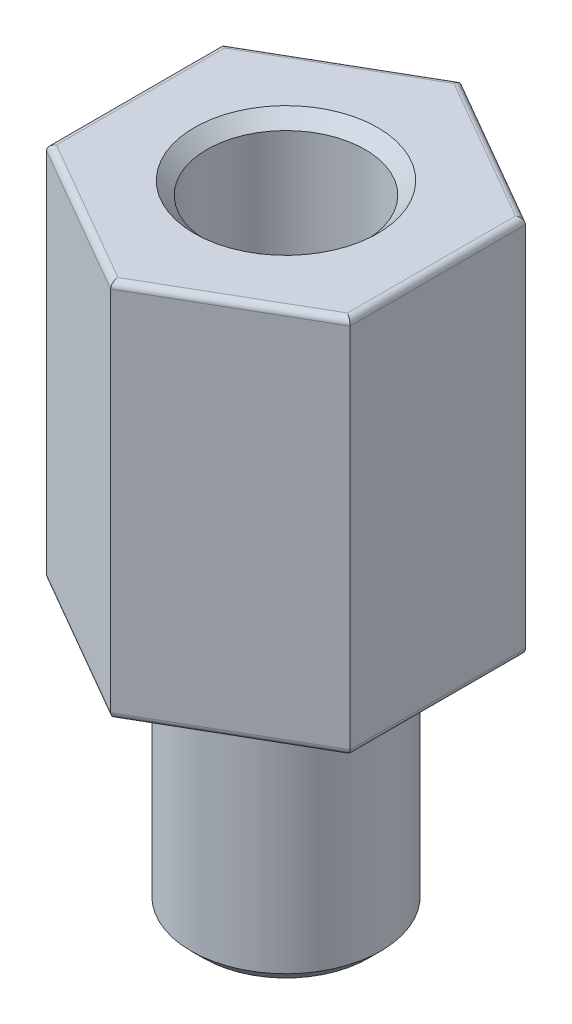
ISO-10303-21;
HEADER;
FILE_DESCRIPTION(('STEP AP214'),'2;1');
FILE_NAME('part.step','',(''),(''),'','','');
FILE_SCHEMA(('AUTOMOTIVE_DESIGN { 1 0 10303 214 1 1 1 1 }'));
ENDSEC;
DATA;
#1=APPLICATION_CONTEXT('core data for automotive mechanical design processes');
#2=APPLICATION_PROTOCOL_DEFINITION('international standard','automotive_design',2000,#1);
#3=PRODUCT_CONTEXT('',#1,'mechanical');
#4=PRODUCT('Part','Part','',(#3));
#5=PRODUCT_RELATED_PRODUCT_CATEGORY('part','',(#4));
#6=PRODUCT_DEFINITION_FORMATION('','',#4);
#7=PRODUCT_DEFINITION_CONTEXT('part definition',#1,'design');
#8=PRODUCT_DEFINITION('design','',#6,#7);
#9=PRODUCT_DEFINITION_SHAPE('','',#8);
#10=(LENGTH_UNIT() NAMED_UNIT(*) SI_UNIT(.MILLI.,.METRE.));
#11=(NAMED_UNIT(*) PLANE_ANGLE_UNIT() SI_UNIT($,.RADIAN.));
#12=(NAMED_UNIT(*) SI_UNIT($,.STERADIAN.) SOLID_ANGLE_UNIT());
#13=UNCERTAINTY_MEASURE_WITH_UNIT(LENGTH_MEASURE(1.E-05),#10,'distance_accuracy_value','');
#14=(GEOMETRIC_REPRESENTATION_CONTEXT(3) GLOBAL_UNCERTAINTY_ASSIGNED_CONTEXT((#13)) GLOBAL_UNIT_ASSIGNED_CONTEXT((#10,
#11,#12)) REPRESENTATION_CONTEXT('',''));
#15=CARTESIAN_POINT('',(0.,0.,0.));
#16=DIRECTION('',(0.,0.,1.));
#17=DIRECTION('',(1.,0.,0.));
#18=AXIS2_PLACEMENT_3D('',#15,#16,#17);
#19=CARTESIAN_POINT('',(0.,4.,0.));
#20=DIRECTION('',(0.,-1.,0.));
#21=DIRECTION('',(0.,0.,-1.));
#22=AXIS2_PLACEMENT_3D('',#19,#20,#21);
#23=CYLINDRICAL_SURFACE('',#22,1.5);
#24=CARTESIAN_POINT('',(0.,0.2,0.));
#25=DIRECTION('',(0.,1.,0.));
#26=DIRECTION('',(0.,0.,1.));
#27=AXIS2_PLACEMENT_3D('',#24,#25,#26);
#28=CIRCLE('',#27,1.5);
#29=CARTESIAN_POINT('',(0.,0.2,1.5));
#30=VERTEX_POINT('',#29);
#31=EDGE_CURVE('E214',#30,#30,#28,.T.);
#32=ORIENTED_EDGE('',*,*,#31,.T.);
#33=EDGE_LOOP('',(#32));
#34=FACE_BOUND('',#33,.T.);
#35=CARTESIAN_POINT('',(0.,4.,0.));
#36=DIRECTION('',(0.,1.,0.));
#37=DIRECTION('',(0.,0.,1.));
#38=AXIS2_PLACEMENT_3D('',#35,#36,#37);
#39=CIRCLE('',#38,1.5);
#40=CARTESIAN_POINT('',(0.,4.,1.5));
#41=VERTEX_POINT('',#40);
#42=EDGE_CURVE('E161',#41,#41,#39,.T.);
#43=ORIENTED_EDGE('',*,*,#42,.F.);
#44=EDGE_LOOP('',(#43));
#45=FACE_BOUND('',#44,.T.);
#46=ADVANCED_FACE('F36',(#34,#45),#23,.T.);
#47=CARTESIAN_POINT('',(0.,0.,0.));
#48=DIRECTION('',(0.,1.,0.));
#49=DIRECTION('',(0.,0.,1.));
#50=AXIS2_PLACEMENT_3D('',#47,#48,#49);
#51=PLANE('',#50);
#52=CARTESIAN_POINT('',(0.,0.,0.));
#53=DIRECTION('',(0.,1.,0.));
#54=DIRECTION('',(0.,0.,1.));
#55=AXIS2_PLACEMENT_3D('',#52,#53,#54);
#56=CIRCLE('',#55,1.3);
#57=CARTESIAN_POINT('',(0.,0.,1.3));
#58=VERTEX_POINT('',#57);
#59=EDGE_CURVE('E245',#58,#58,#56,.F.);
#60=ORIENTED_EDGE('',*,*,#59,.T.);
#61=EDGE_LOOP('',(#60));
#62=FACE_BOUND('',#61,.T.);
#63=ADVANCED_FACE('F260',(#62),#51,.F.);
#64=CARTESIAN_POINT('',(0.,4.,0.));
#65=DIRECTION('',(0.,1.,0.));
#66=DIRECTION('',(0.,0.,1.));
#67=AXIS2_PLACEMENT_3D('',#64,#65,#66);
#68=PLANE('',#67);
#69=DIRECTION('',(-0.866025403784439,0.,-0.5));
#70=VECTOR('',#69,1.);
#71=CARTESIAN_POINT('',(1.15,4.,-1.99185842870421));
#72=LINE('',#71,#70);
#73=CARTESIAN_POINT('',(0.,4.,-2.65581123827228));
#74=VERTEX_POINT('',#73);
#75=CARTESIAN_POINT('',(2.3,4.,-1.32790561913614));
#76=VERTEX_POINT('',#75);
#77=EDGE_CURVE('E169',#74,#76,#72,.F.);
#78=ORIENTED_EDGE('',*,*,#77,.T.);
#79=DIRECTION('',(0.,0.,-1.));
#80=VECTOR('',#79,1.);
#81=CARTESIAN_POINT('',(2.3,4.,0.));
#82=LINE('',#81,#80);
#83=CARTESIAN_POINT('',(2.3,4.,1.32790561913614));
#84=VERTEX_POINT('',#83);
#85=EDGE_CURVE('E179',#76,#84,#82,.F.);
#86=ORIENTED_EDGE('',*,*,#85,.T.);
#87=DIRECTION('',(0.866025403784438,0.,-0.5));
#88=VECTOR('',#87,1.);
#89=CARTESIAN_POINT('',(1.15,4.,1.99185842870421));
#90=LINE('',#89,#88);
#91=CARTESIAN_POINT('',(0.,4.,2.65581123827228));
#92=VERTEX_POINT('',#91);
#93=EDGE_CURVE('E177',#84,#92,#90,.F.);
#94=ORIENTED_EDGE('',*,*,#93,.T.);
#95=DIRECTION('',(0.866025403784439,0.,0.5));
#96=VECTOR('',#95,1.);
#97=CARTESIAN_POINT('',(-1.15,4.,1.99185842870421));
#98=LINE('',#97,#96);
#99=CARTESIAN_POINT('',(-2.3,4.,1.32790561913614));
#100=VERTEX_POINT('',#99);
#101=EDGE_CURVE('E175',#92,#100,#98,.F.);
#102=ORIENTED_EDGE('',*,*,#101,.T.);
#103=DIRECTION('',(0.,0.,1.));
#104=VECTOR('',#103,1.);
#105=CARTESIAN_POINT('',(-2.3,4.,0.));
#106=LINE('',#105,#104);
#107=CARTESIAN_POINT('',(-2.3,4.,-1.32790561913614));
#108=VERTEX_POINT('',#107);
#109=EDGE_CURVE('E173',#100,#108,#106,.F.);
#110=ORIENTED_EDGE('',*,*,#109,.T.);
#111=DIRECTION('',(-0.866025403784439,0.,0.5));
#112=VECTOR('',#111,1.);
#113=CARTESIAN_POINT('',(-1.15,4.,-1.99185842870421));
#114=LINE('',#113,#112);
#115=EDGE_CURVE('E171',#108,#74,#114,.F.);
#116=ORIENTED_EDGE('',*,*,#115,.T.);
#117=EDGE_LOOP('',(#78,#86,#94,#102,#110,#116));
#118=FACE_BOUND('',#117,.T.);
#119=ORIENTED_EDGE('',*,*,#42,.T.);
#120=EDGE_LOOP('',(#119));
#121=FACE_BOUND('',#120,.T.);
#122=ADVANCED_FACE('F266',(#118,#121),#68,.F.);
#123=CARTESIAN_POINT('',(0.,10.,-2.7712812921102));
#124=DIRECTION('',(0.5,0.,0.866025403784439));
#125=DIRECTION('',(0.866025403784439,0.,-0.5));
#126=AXIS2_PLACEMENT_3D('',#123,#124,#125);
#127=PLANE('',#126);
#128=DIRECTION('',(0.,-1.,0.));
#129=VECTOR('',#128,1.);
#130=CARTESIAN_POINT('',(0.,10.,-2.7712812921102));
#131=LINE('',#130,#129);
#132=CARTESIAN_POINT('',(0.,9.9,-2.7712812921102));
#133=VERTEX_POINT('',#132);
#134=CARTESIAN_POINT('',(0.,4.1,-2.7712812921102));
#135=VERTEX_POINT('',#134);
#136=EDGE_CURVE('E142',#133,#135,#131,.T.);
#137=ORIENTED_EDGE('',*,*,#136,.T.);
#138=DIRECTION('',(-0.866025403784439,0.,0.5));
#139=VECTOR('',#138,1.);
#140=CARTESIAN_POINT('',(0.,4.1,-2.7712812921102));
#141=LINE('',#140,#139);
#142=CARTESIAN_POINT('',(-2.4,4.1,-1.3856406460551));
#143=VERTEX_POINT('',#142);
#144=EDGE_CURVE('E197',#135,#143,#141,.T.);
#145=ORIENTED_EDGE('',*,*,#144,.T.);
#146=DIRECTION('',(0.,-1.,0.));
#147=VECTOR('',#146,1.);
#148=CARTESIAN_POINT('',(-2.4,10.,-1.3856406460551));
#149=LINE('',#148,#147);
#150=CARTESIAN_POINT('',(-2.4,9.9,-1.3856406460551));
#151=VERTEX_POINT('',#150);
#152=EDGE_CURVE('E158',#151,#143,#149,.T.);
#153=ORIENTED_EDGE('',*,*,#152,.F.);
#154=DIRECTION('',(-0.866025403784439,0.,0.5));
#155=VECTOR('',#154,1.);
#156=CARTESIAN_POINT('',(0.,9.9,-2.7712812921102));
#157=LINE('',#156,#155);
#158=EDGE_CURVE('E194',#151,#133,#157,.F.);
#159=ORIENTED_EDGE('',*,*,#158,.T.);
#160=EDGE_LOOP('',(#137,#145,#153,#159));
#161=FACE_BOUND('',#160,.T.);
#162=ADVANCED_FACE('F365',(#161),#127,.F.);
#163=CARTESIAN_POINT('',(-2.4,10.,-1.3856406460551));
#164=DIRECTION('',(1.,0.,0.));
#165=DIRECTION('',(0.,0.,-1.));
#166=AXIS2_PLACEMENT_3D('',#163,#164,#165);
#167=PLANE('',#166);
#168=ORIENTED_EDGE('',*,*,#152,.T.);
#169=DIRECTION('',(0.,0.,1.));
#170=VECTOR('',#169,1.);
#171=CARTESIAN_POINT('',(-2.4,4.1,-1.3856406460551));
#172=LINE('',#171,#170);
#173=CARTESIAN_POINT('',(-2.4,4.1,1.3856406460551));
#174=VERTEX_POINT('',#173);
#175=EDGE_CURVE('E192',#143,#174,#172,.T.);
#176=ORIENTED_EDGE('',*,*,#175,.T.);
#177=DIRECTION('',(0.,-1.,0.));
#178=VECTOR('',#177,1.);
#179=CARTESIAN_POINT('',(-2.4,10.,1.3856406460551));
#180=LINE('',#179,#178);
#181=CARTESIAN_POINT('',(-2.4,9.9,1.3856406460551));
#182=VERTEX_POINT('',#181);
#183=EDGE_CURVE('E155',#182,#174,#180,.T.);
#184=ORIENTED_EDGE('',*,*,#183,.F.);
#185=DIRECTION('',(0.,0.,1.));
#186=VECTOR('',#185,1.);
#187=CARTESIAN_POINT('',(-2.4,9.9,-1.3856406460551));
#188=LINE('',#187,#186);
#189=EDGE_CURVE('E190',#182,#151,#188,.F.);
#190=ORIENTED_EDGE('',*,*,#189,.T.);
#191=EDGE_LOOP('',(#168,#176,#184,#190));
#192=FACE_BOUND('',#191,.T.);
#193=ADVANCED_FACE('F333',(#192),#167,.F.);
#194=CARTESIAN_POINT('',(-2.4,10.,1.3856406460551));
#195=DIRECTION('',(0.5,0.,-0.866025403784439));
#196=DIRECTION('',(-0.866025403784439,0.,-0.5));
#197=AXIS2_PLACEMENT_3D('',#194,#195,#196);
#198=PLANE('',#197);
#199=ORIENTED_EDGE('',*,*,#183,.T.);
#200=DIRECTION('',(0.866025403784439,0.,0.5));
#201=VECTOR('',#200,1.);
#202=CARTESIAN_POINT('',(-2.4,4.1,1.3856406460551));
#203=LINE('',#202,#201);
#204=CARTESIAN_POINT('',(0.,4.1,2.7712812921102));
#205=VERTEX_POINT('',#204);
#206=EDGE_CURVE('E188',#174,#205,#203,.T.);
#207=ORIENTED_EDGE('',*,*,#206,.T.);
#208=DIRECTION('',(0.,-1.,0.));
#209=VECTOR('',#208,1.);
#210=CARTESIAN_POINT('',(0.,10.,2.7712812921102));
#211=LINE('',#210,#209);
#212=CARTESIAN_POINT('',(0.,9.9,2.7712812921102));
#213=VERTEX_POINT('',#212);
#214=EDGE_CURVE('E152',#213,#205,#211,.T.);
#215=ORIENTED_EDGE('',*,*,#214,.F.);
#216=DIRECTION('',(0.866025403784439,0.,0.5));
#217=VECTOR('',#216,1.);
#218=CARTESIAN_POINT('',(-2.4,9.9,1.3856406460551));
#219=LINE('',#218,#217);
#220=EDGE_CURVE('E186',#213,#182,#219,.F.);
#221=ORIENTED_EDGE('',*,*,#220,.T.);
#222=EDGE_LOOP('',(#199,#207,#215,#221));
#223=FACE_BOUND('',#222,.T.);
#224=ADVANCED_FACE('F330',(#223),#198,.F.);
#225=CARTESIAN_POINT('',(0.,10.,2.7712812921102));
#226=DIRECTION('',(-0.5,0.,-0.866025403784438));
#227=DIRECTION('',(-0.866025403784438,0.,0.5));
#228=AXIS2_PLACEMENT_3D('',#225,#226,#227);
#229=PLANE('',#228);
#230=ORIENTED_EDGE('',*,*,#214,.T.);
#231=DIRECTION('',(0.866025403784438,0.,-0.5));
#232=VECTOR('',#231,1.);
#233=CARTESIAN_POINT('',(0.,4.1,2.7712812921102));
#234=LINE('',#233,#232);
#235=CARTESIAN_POINT('',(2.4,4.1,1.3856406460551));
#236=VERTEX_POINT('',#235);
#237=EDGE_CURVE('E184',#205,#236,#234,.T.);
#238=ORIENTED_EDGE('',*,*,#237,.T.);
#239=DIRECTION('',(0.,-1.,0.));
#240=VECTOR('',#239,1.);
#241=CARTESIAN_POINT('',(2.4,10.,1.3856406460551));
#242=LINE('',#241,#240);
#243=CARTESIAN_POINT('',(2.4,9.9,1.3856406460551));
#244=VERTEX_POINT('',#243);
#245=EDGE_CURVE('E149',#244,#236,#242,.T.);
#246=ORIENTED_EDGE('',*,*,#245,.F.);
#247=DIRECTION('',(0.866025403784438,0.,-0.5));
#248=VECTOR('',#247,1.);
#249=CARTESIAN_POINT('',(0.,9.9,2.7712812921102));
#250=LINE('',#249,#248);
#251=EDGE_CURVE('E182',#244,#213,#250,.F.);
#252=ORIENTED_EDGE('',*,*,#251,.T.);
#253=EDGE_LOOP('',(#230,#238,#246,#252));
#254=FACE_BOUND('',#253,.T.);
#255=ADVANCED_FACE('F350',(#254),#229,.F.);
#256=CARTESIAN_POINT('',(2.4,10.,1.3856406460551));
#257=DIRECTION('',(-1.,0.,0.));
#258=DIRECTION('',(0.,0.,1.));
#259=AXIS2_PLACEMENT_3D('',#256,#257,#258);
#260=PLANE('',#259);
#261=ORIENTED_EDGE('',*,*,#245,.T.);
#262=DIRECTION('',(0.,0.,-1.));
#263=VECTOR('',#262,1.);
#264=CARTESIAN_POINT('',(2.4,4.1,1.3856406460551));
#265=LINE('',#264,#263);
#266=CARTESIAN_POINT('',(2.4,4.1,-1.3856406460551));
#267=VERTEX_POINT('',#266);
#268=EDGE_CURVE('E166',#236,#267,#265,.T.);
#269=ORIENTED_EDGE('',*,*,#268,.T.);
#270=DIRECTION('',(0.,-1.,0.));
#271=VECTOR('',#270,1.);
#272=CARTESIAN_POINT('',(2.4,10.,-1.3856406460551));
#273=LINE('',#272,#271);
#274=CARTESIAN_POINT('',(2.4,9.9,-1.3856406460551));
#275=VERTEX_POINT('',#274);
#276=EDGE_CURVE('E145',#275,#267,#273,.T.);
#277=ORIENTED_EDGE('',*,*,#276,.F.);
#278=DIRECTION('',(0.,0.,-1.));
#279=VECTOR('',#278,1.);
#280=CARTESIAN_POINT('',(2.4,9.9,1.3856406460551));
#281=LINE('',#280,#279);
#282=EDGE_CURVE('E164',#275,#244,#281,.F.);
#283=ORIENTED_EDGE('',*,*,#282,.T.);
#284=EDGE_LOOP('',(#261,#269,#277,#283));
#285=FACE_BOUND('',#284,.T.);
#286=ADVANCED_FACE('F354',(#285),#260,.F.);
#287=CARTESIAN_POINT('',(2.4,10.,-1.3856406460551));
#288=DIRECTION('',(-0.5,0.,0.866025403784439));
#289=DIRECTION('',(0.866025403784439,0.,0.5));
#290=AXIS2_PLACEMENT_3D('',#287,#288,#289);
#291=PLANE('',#290);
#292=ORIENTED_EDGE('',*,*,#276,.T.);
#293=DIRECTION('',(-0.866025403784439,0.,-0.5));
#294=VECTOR('',#293,1.);
#295=CARTESIAN_POINT('',(2.4,4.1,-1.3856406460551));
#296=LINE('',#295,#294);
#297=EDGE_CURVE('E201',#267,#135,#296,.T.);
#298=ORIENTED_EDGE('',*,*,#297,.T.);
#299=ORIENTED_EDGE('',*,*,#136,.F.);
#300=DIRECTION('',(-0.866025403784439,0.,-0.5));
#301=VECTOR('',#300,1.);
#302=CARTESIAN_POINT('',(2.4,9.9,-1.3856406460551));
#303=LINE('',#302,#301);
#304=EDGE_CURVE('E199',#133,#275,#303,.F.);
#305=ORIENTED_EDGE('',*,*,#304,.T.);
#306=EDGE_LOOP('',(#292,#298,#299,#305));
#307=FACE_BOUND('',#306,.T.);
#308=ADVANCED_FACE('F363',(#307),#291,.F.);
#309=CARTESIAN_POINT('',(0.,10.,0.));
#310=DIRECTION('',(0.,1.,0.));
#311=DIRECTION('',(0.,0.,1.));
#312=AXIS2_PLACEMENT_3D('',#309,#310,#311);
#313=PLANE('',#312);
#314=CARTESIAN_POINT('',(0.,10.,0.));
#315=DIRECTION('',(0.,1.,0.));
#316=DIRECTION('',(0.,0.,1.));
#317=AXIS2_PLACEMENT_3D('',#314,#315,#316);
#318=CIRCLE('',#317,1.45);
#319=CARTESIAN_POINT('',(0.,10.,1.45));
#320=VERTEX_POINT('',#319);
#321=EDGE_CURVE('E11',#320,#320,#318,.F.);
#322=ORIENTED_EDGE('',*,*,#321,.T.);
#323=EDGE_LOOP('',(#322));
#324=FACE_BOUND('',#323,.T.);
#325=DIRECTION('',(-0.866025403784439,0.,-0.5));
#326=VECTOR('',#325,1.);
#327=CARTESIAN_POINT('',(-0.0500000000000006,10.,-2.68467875173176));
#328=LINE('',#327,#326);
#329=CARTESIAN_POINT('',(2.3,10.,-1.32790561913614));
#330=VERTEX_POINT('',#329);
#331=CARTESIAN_POINT('',(0.,10.,-2.65581123827228));
#332=VERTEX_POINT('',#331);
#333=EDGE_CURVE('E203',#330,#332,#328,.T.);
#334=ORIENTED_EDGE('',*,*,#333,.T.);
#335=DIRECTION('',(-0.866025403784439,0.,0.5));
#336=VECTOR('',#335,1.);
#337=CARTESIAN_POINT('',(-2.35,10.,-1.29903810567666));
#338=LINE('',#337,#336);
#339=CARTESIAN_POINT('',(-2.3,10.,-1.32790561913614));
#340=VERTEX_POINT('',#339);
#341=EDGE_CURVE('E212',#332,#340,#338,.T.);
#342=ORIENTED_EDGE('',*,*,#341,.T.);
#343=DIRECTION('',(0.,0.,1.));
#344=VECTOR('',#343,1.);
#345=CARTESIAN_POINT('',(-2.3,10.,1.3856406460551));
#346=LINE('',#345,#344);
#347=CARTESIAN_POINT('',(-2.3,10.,1.32790561913614));
#348=VERTEX_POINT('',#347);
#349=EDGE_CURVE('E58',#340,#348,#346,.T.);
#350=ORIENTED_EDGE('',*,*,#349,.T.);
#351=DIRECTION('',(0.866025403784439,0.,0.5));
#352=VECTOR('',#351,1.);
#353=CARTESIAN_POINT('',(0.0500000000000006,10.,2.68467875173176));
#354=LINE('',#353,#352);
#355=CARTESIAN_POINT('',(0.,10.,2.65581123827228));
#356=VERTEX_POINT('',#355);
#357=EDGE_CURVE('E209',#348,#356,#354,.T.);
#358=ORIENTED_EDGE('',*,*,#357,.T.);
#359=DIRECTION('',(0.866025403784438,0.,-0.5));
#360=VECTOR('',#359,1.);
#361=CARTESIAN_POINT('',(2.35,10.,1.29903810567666));
#362=LINE('',#361,#360);
#363=CARTESIAN_POINT('',(2.3,10.,1.32790561913614));
#364=VERTEX_POINT('',#363);
#365=EDGE_CURVE('E207',#356,#364,#362,.T.);
#366=ORIENTED_EDGE('',*,*,#365,.T.);
#367=DIRECTION('',(0.,0.,-1.));
#368=VECTOR('',#367,1.);
#369=CARTESIAN_POINT('',(2.3,10.,-1.3856406460551));
#370=LINE('',#369,#368);
#371=EDGE_CURVE('E205',#364,#330,#370,.T.);
#372=ORIENTED_EDGE('',*,*,#371,.T.);
#373=EDGE_LOOP('',(#334,#342,#350,#358,#366,#372));
#374=FACE_BOUND('',#373,.T.);
#375=ADVANCED_FACE('F296',(#324,#374),#313,.T.);
#376=CARTESIAN_POINT('',(-2.3,4.1,-1.3856406460551));
#377=DIRECTION('',(0.,0.,1.));
#378=DIRECTION('',(1.,0.,0.));
#379=AXIS2_PLACEMENT_3D('',#376,#377,#378);
#380=CYLINDRICAL_SURFACE('',#379,0.1);
#381=CARTESIAN_POINT('',(-2.3,4.1,-1.32790561913614));
#382=DIRECTION('',(-0.5,0.,0.866025403784439));
#383=DIRECTION('',(-0.866025403784439,0.,-0.5));
#384=AXIS2_PLACEMENT_3D('',#381,#382,#383);
#385=ELLIPSE('',#384,0.115470053837925,0.1);
#386=EDGE_CURVE('E226',#108,#143,#385,.F.);
#387=ORIENTED_EDGE('',*,*,#386,.F.);
#388=ORIENTED_EDGE('',*,*,#109,.F.);
#389=CARTESIAN_POINT('',(-2.3,4.1,1.32790561913614));
#390=DIRECTION('',(0.5,0.,0.866025403784439));
#391=DIRECTION('',(-0.866025403784439,0.,0.5));
#392=AXIS2_PLACEMENT_3D('',#389,#390,#391);
#393=ELLIPSE('',#392,0.115470053837925,0.1);
#394=EDGE_CURVE('E146',#174,#100,#393,.T.);
#395=ORIENTED_EDGE('',*,*,#394,.F.);
#396=ORIENTED_EDGE('',*,*,#175,.F.);
#397=EDGE_LOOP('',(#387,#388,#395,#396));
#398=FACE_BOUND('',#397,.T.);
#399=ADVANCED_FACE('F292',(#398),#380,.T.);
#400=CARTESIAN_POINT('',(-2.35,4.1,1.29903810567666));
#401=DIRECTION('',(0.866025403784439,0.,0.5));
#402=DIRECTION('',(0.5,0.,-0.866025403784439));
#403=AXIS2_PLACEMENT_3D('',#400,#401,#402);
#404=CYLINDRICAL_SURFACE('',#403,0.1);
#405=ORIENTED_EDGE('',*,*,#394,.T.);
#406=ORIENTED_EDGE('',*,*,#101,.F.);
#407=CARTESIAN_POINT('',(0.,4.1,2.65581123827228));
#408=DIRECTION('',(1.,0.,0.));
#409=DIRECTION('',(0.,0.,1.));
#410=AXIS2_PLACEMENT_3D('',#407,#408,#409);
#411=ELLIPSE('',#410,0.115470053837925,0.1);
#412=EDGE_CURVE('E223',#205,#92,#411,.T.);
#413=ORIENTED_EDGE('',*,*,#412,.F.);
#414=ORIENTED_EDGE('',*,*,#206,.F.);
#415=EDGE_LOOP('',(#405,#406,#413,#414));
#416=FACE_BOUND('',#415,.T.);
#417=ADVANCED_FACE('F288',(#416),#404,.T.);
#418=CARTESIAN_POINT('',(0.05,4.1,-2.68467875173176));
#419=DIRECTION('',(-0.866025403784439,0.,0.5));
#420=DIRECTION('',(0.5,0.,0.866025403784439));
#421=AXIS2_PLACEMENT_3D('',#418,#419,#420);
#422=CYLINDRICAL_SURFACE('',#421,0.1);
#423=ORIENTED_EDGE('',*,*,#386,.T.);
#424=ORIENTED_EDGE('',*,*,#144,.F.);
#425=CARTESIAN_POINT('',(0.,4.1,-2.65581123827228));
#426=DIRECTION('',(-1.,0.,0.));
#427=DIRECTION('',(0.,0.,-1.));
#428=AXIS2_PLACEMENT_3D('',#425,#426,#427);
#429=ELLIPSE('',#428,0.115470053837925,0.1);
#430=EDGE_CURVE('E220',#74,#135,#429,.F.);
#431=ORIENTED_EDGE('',*,*,#430,.F.);
#432=ORIENTED_EDGE('',*,*,#115,.F.);
#433=EDGE_LOOP('',(#423,#424,#431,#432));
#434=FACE_BOUND('',#433,.T.);
#435=ADVANCED_FACE('F284',(#434),#422,.T.);
#436=CARTESIAN_POINT('',(-0.0500000000000001,4.1,2.68467875173176));
#437=DIRECTION('',(0.866025403784438,0.,-0.5));
#438=DIRECTION('',(-0.5,0.,-0.866025403784438));
#439=AXIS2_PLACEMENT_3D('',#436,#437,#438);
#440=CYLINDRICAL_SURFACE('',#439,0.1);
#441=ORIENTED_EDGE('',*,*,#412,.T.);
#442=ORIENTED_EDGE('',*,*,#93,.F.);
#443=CARTESIAN_POINT('',(2.3,4.1,1.32790561913614));
#444=DIRECTION('',(0.5,0.,-0.866025403784439));
#445=DIRECTION('',(0.866025403784439,0.,0.5));
#446=AXIS2_PLACEMENT_3D('',#443,#444,#445);
#447=ELLIPSE('',#446,0.115470053837925,0.1);
#448=EDGE_CURVE('E217',#236,#84,#447,.T.);
#449=ORIENTED_EDGE('',*,*,#448,.F.);
#450=ORIENTED_EDGE('',*,*,#237,.F.);
#451=EDGE_LOOP('',(#441,#442,#449,#450));
#452=FACE_BOUND('',#451,.T.);
#453=ADVANCED_FACE('F280',(#452),#440,.T.);
#454=CARTESIAN_POINT('',(2.35,4.1,-1.29903810567666));
#455=DIRECTION('',(-0.866025403784439,0.,-0.5));
#456=DIRECTION('',(-0.5,0.,0.866025403784439));
#457=AXIS2_PLACEMENT_3D('',#454,#455,#456);
#458=CYLINDRICAL_SURFACE('',#457,0.1);
#459=ORIENTED_EDGE('',*,*,#430,.T.);
#460=ORIENTED_EDGE('',*,*,#297,.F.);
#461=CARTESIAN_POINT('',(2.3,4.1,-1.32790561913614));
#462=DIRECTION('',(-0.5,0.,-0.866025403784438));
#463=DIRECTION('',(-0.866025403784439,0.,0.5));
#464=AXIS2_PLACEMENT_3D('',#461,#462,#463);
#465=ELLIPSE('',#464,0.115470053837925,0.1);
#466=EDGE_CURVE('E215',#76,#267,#465,.F.);
#467=ORIENTED_EDGE('',*,*,#466,.F.);
#468=ORIENTED_EDGE('',*,*,#77,.F.);
#469=EDGE_LOOP('',(#459,#460,#467,#468));
#470=FACE_BOUND('',#469,.T.);
#471=ADVANCED_FACE('F276',(#470),#458,.T.);
#472=CARTESIAN_POINT('',(2.3,4.1,1.3856406460551));
#473=DIRECTION('',(0.,0.,-1.));
#474=DIRECTION('',(-1.,0.,0.));
#475=AXIS2_PLACEMENT_3D('',#472,#473,#474);
#476=CYLINDRICAL_SURFACE('',#475,0.1);
#477=ORIENTED_EDGE('',*,*,#448,.T.);
#478=ORIENTED_EDGE('',*,*,#85,.F.);
#479=ORIENTED_EDGE('',*,*,#466,.T.);
#480=ORIENTED_EDGE('',*,*,#268,.F.);
#481=EDGE_LOOP('',(#477,#478,#479,#480));
#482=FACE_BOUND('',#481,.T.);
#483=ADVANCED_FACE('F272',(#482),#476,.T.);
#484=CARTESIAN_POINT('',(1.15,9.9,1.99185842870421));
#485=DIRECTION('',(-0.866025403784438,0.,0.5));
#486=DIRECTION('',(0.5,0.,0.866025403784438));
#487=AXIS2_PLACEMENT_3D('',#484,#485,#486);
#488=CYLINDRICAL_SURFACE('',#487,0.1);
#489=CARTESIAN_POINT('',(0.,9.9,2.65581123827228));
#490=DIRECTION('',(-1.,0.,0.));
#491=DIRECTION('',(0.,0.,1.));
#492=AXIS2_PLACEMENT_3D('',#489,#490,#491);
#493=ELLIPSE('',#492,0.115470053837925,0.1);
#494=EDGE_CURVE('E238',#213,#356,#493,.T.);
#495=ORIENTED_EDGE('',*,*,#494,.F.);
#496=ORIENTED_EDGE('',*,*,#251,.F.);
#497=CARTESIAN_POINT('',(2.3,9.9,1.32790561913614));
#498=DIRECTION('',(-0.5,0.,0.866025403784439));
#499=DIRECTION('',(0.866025403784439,0.,0.5));
#500=AXIS2_PLACEMENT_3D('',#497,#498,#499);
#501=ELLIPSE('',#500,0.115470053837925,0.1);
#502=EDGE_CURVE('E218',#364,#244,#501,.F.);
#503=ORIENTED_EDGE('',*,*,#502,.F.);
#504=ORIENTED_EDGE('',*,*,#365,.F.);
#505=EDGE_LOOP('',(#495,#496,#503,#504));
#506=FACE_BOUND('',#505,.T.);
#507=ADVANCED_FACE('F275',(#506),#488,.T.);
#508=CARTESIAN_POINT('',(2.3,9.9,0.));
#509=DIRECTION('',(0.,0.,1.));
#510=DIRECTION('',(1.,0.,0.));
#511=AXIS2_PLACEMENT_3D('',#508,#509,#510);
#512=CYLINDRICAL_SURFACE('',#511,0.1);
#513=ORIENTED_EDGE('',*,*,#502,.T.);
#514=ORIENTED_EDGE('',*,*,#282,.F.);
#515=CARTESIAN_POINT('',(2.3,9.9,-1.32790561913614));
#516=DIRECTION('',(0.5,0.,0.866025403784438));
#517=DIRECTION('',(0.866025403784439,0.,-0.5));
#518=AXIS2_PLACEMENT_3D('',#515,#516,#517);
#519=ELLIPSE('',#518,0.115470053837925,0.1);
#520=EDGE_CURVE('E235',#330,#275,#519,.F.);
#521=ORIENTED_EDGE('',*,*,#520,.F.);
#522=ORIENTED_EDGE('',*,*,#371,.F.);
#523=EDGE_LOOP('',(#513,#514,#521,#522));
#524=FACE_BOUND('',#523,.T.);
#525=ADVANCED_FACE('F311',(#524),#512,.T.);
#526=CARTESIAN_POINT('',(-1.15,9.9,1.99185842870421));
#527=DIRECTION('',(-0.866025403784439,0.,-0.5));
#528=DIRECTION('',(-0.5,0.,0.866025403784439));
#529=AXIS2_PLACEMENT_3D('',#526,#527,#528);
#530=CYLINDRICAL_SURFACE('',#529,0.1);
#531=ORIENTED_EDGE('',*,*,#494,.T.);
#532=ORIENTED_EDGE('',*,*,#357,.F.);
#533=CARTESIAN_POINT('',(-2.3,9.9,1.32790561913614));
#534=DIRECTION('',(-0.5,0.,-0.866025403784439));
#535=DIRECTION('',(-0.866025403784439,0.,0.5));
#536=AXIS2_PLACEMENT_3D('',#533,#534,#535);
#537=ELLIPSE('',#536,0.115470053837925,0.1);
#538=EDGE_CURVE('E232',#182,#348,#537,.T.);
#539=ORIENTED_EDGE('',*,*,#538,.F.);
#540=ORIENTED_EDGE('',*,*,#220,.F.);
#541=EDGE_LOOP('',(#531,#532,#539,#540));
#542=FACE_BOUND('',#541,.T.);
#543=ADVANCED_FACE('F307',(#542),#530,.T.);
#544=CARTESIAN_POINT('',(1.15,9.9,-1.99185842870421));
#545=DIRECTION('',(0.866025403784439,0.,0.5));
#546=DIRECTION('',(0.5,0.,-0.866025403784439));
#547=AXIS2_PLACEMENT_3D('',#544,#545,#546);
#548=CYLINDRICAL_SURFACE('',#547,0.1);
#549=ORIENTED_EDGE('',*,*,#520,.T.);
#550=ORIENTED_EDGE('',*,*,#304,.F.);
#551=CARTESIAN_POINT('',(0.,9.9,-2.65581123827228));
#552=DIRECTION('',(1.,0.,0.));
#553=DIRECTION('',(0.,0.,1.));
#554=AXIS2_PLACEMENT_3D('',#551,#552,#553);
#555=ELLIPSE('',#554,0.115470053837925,0.1);
#556=EDGE_CURVE('E139',#332,#133,#555,.F.);
#557=ORIENTED_EDGE('',*,*,#556,.F.);
#558=ORIENTED_EDGE('',*,*,#333,.F.);
#559=EDGE_LOOP('',(#549,#550,#557,#558));
#560=FACE_BOUND('',#559,.T.);
#561=ADVANCED_FACE('F303',(#560),#548,.T.);
#562=CARTESIAN_POINT('',(-2.3,9.9,0.));
#563=DIRECTION('',(0.,0.,-1.));
#564=DIRECTION('',(-1.,0.,0.));
#565=AXIS2_PLACEMENT_3D('',#562,#563,#564);
#566=CYLINDRICAL_SURFACE('',#565,0.1);
#567=ORIENTED_EDGE('',*,*,#538,.T.);
#568=ORIENTED_EDGE('',*,*,#349,.F.);
#569=CARTESIAN_POINT('',(-2.3,9.9,-1.32790561913614));
#570=DIRECTION('',(0.5,0.,-0.866025403784439));
#571=DIRECTION('',(-0.866025403784439,0.,-0.5));
#572=AXIS2_PLACEMENT_3D('',#569,#570,#571);
#573=ELLIPSE('',#572,0.115470053837925,0.1);
#574=EDGE_CURVE('E51',#151,#340,#573,.T.);
#575=ORIENTED_EDGE('',*,*,#574,.F.);
#576=ORIENTED_EDGE('',*,*,#189,.F.);
#577=EDGE_LOOP('',(#567,#568,#575,#576));
#578=FACE_BOUND('',#577,.T.);
#579=ADVANCED_FACE('F300',(#578),#566,.T.);
#580=CARTESIAN_POINT('',(-1.15,9.9,-1.99185842870421));
#581=DIRECTION('',(0.866025403784439,0.,-0.5));
#582=DIRECTION('',(-0.5,0.,-0.866025403784439));
#583=AXIS2_PLACEMENT_3D('',#580,#581,#582);
#584=CYLINDRICAL_SURFACE('',#583,0.1);
#585=ORIENTED_EDGE('',*,*,#556,.T.);
#586=ORIENTED_EDGE('',*,*,#158,.F.);
#587=ORIENTED_EDGE('',*,*,#574,.T.);
#588=ORIENTED_EDGE('',*,*,#341,.F.);
#589=EDGE_LOOP('',(#585,#586,#587,#588));
#590=FACE_BOUND('',#589,.T.);
#591=ADVANCED_FACE('F132',(#590),#584,.T.);
#592=CARTESIAN_POINT('',(0.,5.,0.));
#593=DIRECTION('',(0.,1.,0.));
#594=DIRECTION('',(0.,0.,1.));
#595=AXIS2_PLACEMENT_3D('',#592,#593,#594);
#596=CONICAL_SURFACE('',#595,1.25,1.02974425867665);
#597=CARTESIAN_POINT('',(0.,4.24892422621555,0.));
#598=VERTEX_POINT('',#597);
#599=VERTEX_LOOP('',#598);
#600=FACE_BOUND('',#599,.T.);
#601=CARTESIAN_POINT('',(0.,5.,0.));
#602=DIRECTION('',(0.,1.,0.));
#603=DIRECTION('',(0.,0.,1.));
#604=AXIS2_PLACEMENT_3D('',#601,#602,#603);
#605=CIRCLE('',#604,1.25);
#606=CARTESIAN_POINT('',(0.,5.,1.25));
#607=VERTEX_POINT('',#606);
#608=EDGE_CURVE('E136',#607,#607,#605,.T.);
#609=ORIENTED_EDGE('',*,*,#608,.T.);
#610=EDGE_LOOP('',(#609));
#611=FACE_BOUND('',#610,.T.);
#612=ADVANCED_FACE('F128',(#600,#611),#596,.F.);
#613=CARTESIAN_POINT('',(0.,10.,0.));
#614=DIRECTION('',(0.,1.,0.));
#615=DIRECTION('',(0.,0.,1.));
#616=AXIS2_PLACEMENT_3D('',#613,#614,#615);
#617=CYLINDRICAL_SURFACE('',#616,1.25);
#618=CARTESIAN_POINT('',(0.,9.8,0.));
#619=DIRECTION('',(0.,1.,0.));
#620=DIRECTION('',(0.,0.,1.));
#621=AXIS2_PLACEMENT_3D('',#618,#619,#620);
#622=CIRCLE('',#621,1.25);
#623=CARTESIAN_POINT('',(0.,9.8,1.25));
#624=VERTEX_POINT('',#623);
#625=EDGE_CURVE('E44',#624,#624,#622,.T.);
#626=ORIENTED_EDGE('',*,*,#625,.T.);
#627=EDGE_LOOP('',(#626));
#628=FACE_BOUND('',#627,.T.);
#629=ORIENTED_EDGE('',*,*,#608,.F.);
#630=EDGE_LOOP('',(#629));
#631=FACE_BOUND('',#630,.T.);
#632=ADVANCED_FACE('F131',(#628,#631),#617,.F.);
#633=CARTESIAN_POINT('',(0.,0.2,0.));
#634=DIRECTION('',(0.,1.,0.));
#635=DIRECTION('',(0.,0.,1.));
#636=AXIS2_PLACEMENT_3D('',#633,#634,#635);
#637=CONICAL_SURFACE('',#636,1.5,0.785398163397448);
#638=ORIENTED_EDGE('',*,*,#59,.F.);
#639=EDGE_LOOP('',(#638));
#640=FACE_BOUND('',#639,.T.);
#641=ORIENTED_EDGE('',*,*,#31,.F.);
#642=EDGE_LOOP('',(#641));
#643=FACE_BOUND('',#642,.T.);
#644=ADVANCED_FACE('F252',(#640,#643),#637,.T.);
#645=CARTESIAN_POINT('',(0.,9.8,0.));
#646=DIRECTION('',(0.,1.,0.));
#647=DIRECTION('',(0.,0.,1.));
#648=AXIS2_PLACEMENT_3D('',#645,#646,#647);
#649=CONICAL_SURFACE('',#648,1.25,0.785398163397449);
#650=ORIENTED_EDGE('',*,*,#321,.F.);
#651=EDGE_LOOP('',(#650));
#652=FACE_BOUND('',#651,.T.);
#653=ORIENTED_EDGE('',*,*,#625,.F.);
#654=EDGE_LOOP('',(#653));
#655=FACE_BOUND('',#654,.T.);
#656=ADVANCED_FACE('F38',(#652,#655),#649,.F.);
#657=CLOSED_SHELL('',(#46,#63,#122,#162,#193,#224,#255,#286,#308,#375,#399,#417,#435,#453,#471,
#483,#507,#525,#543,#561,#579,#591,#612,#632,#644,#656));
#658=MANIFOLD_SOLID_BREP('B2',#657);
#659=ADVANCED_BREP_SHAPE_REPRESENTATION('',(#18,#658),#14);
#660=SHAPE_DEFINITION_REPRESENTATION(#9,#659);
ENDSEC;
END-ISO-10303-21;
